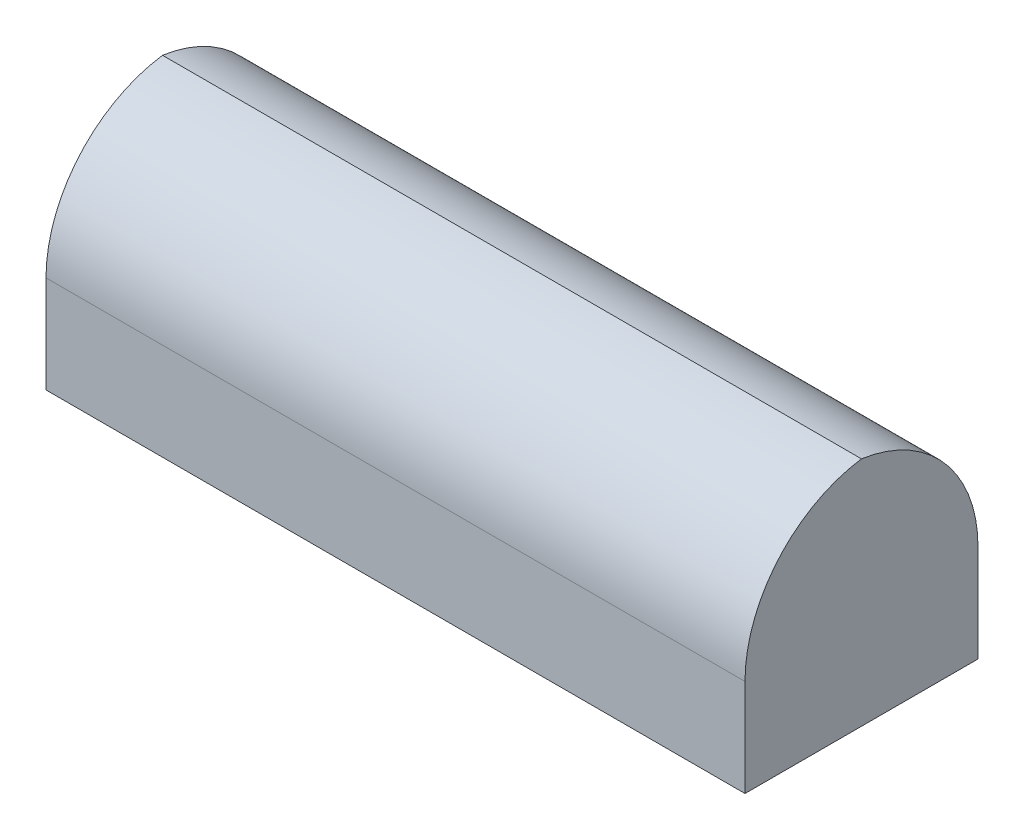
ISO-10303-21;
HEADER;
FILE_DESCRIPTION(('STEP AP214'),'2;1');
FILE_NAME('part.step','',(''),(''),'','','');
FILE_SCHEMA(('AUTOMOTIVE_DESIGN { 1 0 10303 214 1 1 1 1 }'));
ENDSEC;
DATA;
#1=APPLICATION_CONTEXT('core data for automotive mechanical design processes');
#2=APPLICATION_PROTOCOL_DEFINITION('international standard','automotive_design',2000,#1);
#3=PRODUCT_CONTEXT('',#1,'mechanical');
#4=PRODUCT('Part','Part','',(#3));
#5=PRODUCT_RELATED_PRODUCT_CATEGORY('part','',(#4));
#6=PRODUCT_DEFINITION_FORMATION('','',#4);
#7=PRODUCT_DEFINITION_CONTEXT('part definition',#1,'design');
#8=PRODUCT_DEFINITION('design','',#6,#7);
#9=PRODUCT_DEFINITION_SHAPE('','',#8);
#10=(LENGTH_UNIT() NAMED_UNIT(*) SI_UNIT(.MILLI.,.METRE.));
#11=(NAMED_UNIT(*) PLANE_ANGLE_UNIT() SI_UNIT($,.RADIAN.));
#12=(NAMED_UNIT(*) SI_UNIT($,.STERADIAN.) SOLID_ANGLE_UNIT());
#13=UNCERTAINTY_MEASURE_WITH_UNIT(LENGTH_MEASURE(1.E-05),#10,'distance_accuracy_value','');
#14=(GEOMETRIC_REPRESENTATION_CONTEXT(3) GLOBAL_UNCERTAINTY_ASSIGNED_CONTEXT((#13)) GLOBAL_UNIT_ASSIGNED_CONTEXT((#10,
#11,#12)) REPRESENTATION_CONTEXT('',''));
#15=CARTESIAN_POINT('',(0.,0.,0.));
#16=DIRECTION('',(0.,0.,1.));
#17=DIRECTION('',(1.,0.,0.));
#18=AXIS2_PLACEMENT_3D('',#15,#16,#17);
#19=CARTESIAN_POINT('',(0.,5.35,-1.85));
#20=DIRECTION('',(1.,0.,0.));
#21=DIRECTION('',(0.,0.,-1.));
#22=AXIS2_PLACEMENT_3D('',#19,#20,#21);
#23=CYLINDRICAL_SURFACE('',#22,0.7);
#24=DIRECTION('',(-1.,0.,0.));
#25=VECTOR('',#24,1.);
#26=CARTESIAN_POINT('',(0.,6.04282032302755,-1.95));
#27=LINE('',#26,#25);
#28=CARTESIAN_POINT('',(4.65,6.04282032302755,-1.95));
#29=VERTEX_POINT('',#28);
#30=CARTESIAN_POINT('',(1.05,6.04282032302755,-1.95));
#31=VERTEX_POINT('',#30);
#32=EDGE_CURVE('E63',#29,#31,#27,.T.);
#33=ORIENTED_EDGE('',*,*,#32,.F.);
#34=CARTESIAN_POINT('',(4.65,5.35,-1.85));
#35=DIRECTION('',(1.,0.,0.));
#36=DIRECTION('',(0.,0.,-1.));
#37=AXIS2_PLACEMENT_3D('',#34,#35,#36);
#38=CIRCLE('',#37,0.7);
#39=CARTESIAN_POINT('',(4.65,5.35,-2.55));
#40=VERTEX_POINT('',#39);
#41=EDGE_CURVE('E86',#29,#40,#38,.F.);
#42=ORIENTED_EDGE('',*,*,#41,.T.);
#43=DIRECTION('',(1.,0.,0.));
#44=VECTOR('',#43,1.);
#45=CARTESIAN_POINT('',(4.65,5.35,-2.55));
#46=LINE('',#45,#44);
#47=CARTESIAN_POINT('',(1.05,5.35,-2.55));
#48=VERTEX_POINT('',#47);
#49=EDGE_CURVE('E66',#40,#48,#46,.F.);
#50=ORIENTED_EDGE('',*,*,#49,.T.);
#51=CARTESIAN_POINT('',(1.05,5.35,-1.85));
#52=DIRECTION('',(1.,0.,0.));
#53=DIRECTION('',(0.,0.,-1.));
#54=AXIS2_PLACEMENT_3D('',#51,#52,#53);
#55=CIRCLE('',#54,0.7);
#56=EDGE_CURVE('E20',#48,#31,#55,.T.);
#57=ORIENTED_EDGE('',*,*,#56,.T.);
#58=EDGE_LOOP('',(#33,#42,#50,#57));
#59=FACE_BOUND('',#58,.T.);
#60=ADVANCED_FACE('F17',(#59),#23,.T.);
#61=CARTESIAN_POINT('',(0.,5.35,-2.05));
#62=DIRECTION('',(-1.,0.,0.));
#63=DIRECTION('',(0.,0.,1.));
#64=AXIS2_PLACEMENT_3D('',#61,#62,#63);
#65=CYLINDRICAL_SURFACE('',#64,0.7);
#66=CARTESIAN_POINT('',(4.65,5.35,-2.05));
#67=DIRECTION('',(-1.,0.,0.));
#68=DIRECTION('',(0.,0.,1.));
#69=AXIS2_PLACEMENT_3D('',#66,#67,#68);
#70=CIRCLE('',#69,0.7);
#71=CARTESIAN_POINT('',(4.65,5.35,-1.35));
#72=VERTEX_POINT('',#71);
#73=EDGE_CURVE('E73',#72,#29,#70,.T.);
#74=ORIENTED_EDGE('',*,*,#73,.T.);
#75=ORIENTED_EDGE('',*,*,#32,.T.);
#76=CARTESIAN_POINT('',(1.05,5.35,-2.05));
#77=DIRECTION('',(-1.,0.,0.));
#78=DIRECTION('',(0.,0.,1.));
#79=AXIS2_PLACEMENT_3D('',#76,#77,#78);
#80=CIRCLE('',#79,0.7);
#81=CARTESIAN_POINT('',(1.05,5.35,-1.35));
#82=VERTEX_POINT('',#81);
#83=EDGE_CURVE('E72',#31,#82,#80,.F.);
#84=ORIENTED_EDGE('',*,*,#83,.T.);
#85=DIRECTION('',(-1.,0.,0.));
#86=VECTOR('',#85,1.);
#87=CARTESIAN_POINT('',(1.05,5.35,-1.35));
#88=LINE('',#87,#86);
#89=EDGE_CURVE('E79',#82,#72,#88,.F.);
#90=ORIENTED_EDGE('',*,*,#89,.T.);
#91=EDGE_LOOP('',(#74,#75,#84,#90));
#92=FACE_BOUND('',#91,.T.);
#93=ADVANCED_FACE('F70',(#92),#65,.T.);
#94=CARTESIAN_POINT('',(4.65,6.05,-1.35));
#95=DIRECTION('',(-1.,0.,0.));
#96=DIRECTION('',(0.,0.,1.));
#97=AXIS2_PLACEMENT_3D('',#94,#95,#96);
#98=PLANE('',#97);
#99=ORIENTED_EDGE('',*,*,#73,.F.);
#100=DIRECTION('',(0.,1.,0.));
#101=VECTOR('',#100,1.);
#102=CARTESIAN_POINT('',(4.65,6.05,-1.35));
#103=LINE('',#102,#101);
#104=CARTESIAN_POINT('',(4.65,4.85,-1.35));
#105=VERTEX_POINT('',#104);
#106=EDGE_CURVE('E109',#72,#105,#103,.F.);
#107=ORIENTED_EDGE('',*,*,#106,.T.);
#108=DIRECTION('',(0.,0.,1.));
#109=VECTOR('',#108,1.);
#110=CARTESIAN_POINT('',(4.65,4.85,0.));
#111=LINE('',#110,#109);
#112=CARTESIAN_POINT('',(4.65,4.85,-2.55));
#113=VERTEX_POINT('',#112);
#114=EDGE_CURVE('E97',#105,#113,#111,.F.);
#115=ORIENTED_EDGE('',*,*,#114,.T.);
#116=DIRECTION('',(0.,1.,0.));
#117=VECTOR('',#116,1.);
#118=CARTESIAN_POINT('',(4.65,6.05,-2.55));
#119=LINE('',#118,#117);
#120=EDGE_CURVE('E87',#113,#40,#119,.T.);
#121=ORIENTED_EDGE('',*,*,#120,.T.);
#122=ORIENTED_EDGE('',*,*,#41,.F.);
#123=EDGE_LOOP('',(#99,#107,#115,#121,#122));
#124=FACE_BOUND('',#123,.T.);
#125=ADVANCED_FACE('F118',(#124),#98,.F.);
#126=CARTESIAN_POINT('',(4.65,6.05,-2.55));
#127=DIRECTION('',(0.,0.,1.));
#128=DIRECTION('',(1.,0.,0.));
#129=AXIS2_PLACEMENT_3D('',#126,#127,#128);
#130=PLANE('',#129);
#131=ORIENTED_EDGE('',*,*,#49,.F.);
#132=ORIENTED_EDGE('',*,*,#120,.F.);
#133=DIRECTION('',(1.,0.,0.));
#134=VECTOR('',#133,1.);
#135=CARTESIAN_POINT('',(0.,4.85,-2.55));
#136=LINE('',#135,#134);
#137=CARTESIAN_POINT('',(1.05,4.85,-2.55));
#138=VERTEX_POINT('',#137);
#139=EDGE_CURVE('E95',#113,#138,#136,.F.);
#140=ORIENTED_EDGE('',*,*,#139,.T.);
#141=DIRECTION('',(0.,1.,0.));
#142=VECTOR('',#141,1.);
#143=CARTESIAN_POINT('',(1.05,6.05,-2.55));
#144=LINE('',#143,#142);
#145=EDGE_CURVE('E77',#138,#48,#144,.T.);
#146=ORIENTED_EDGE('',*,*,#145,.T.);
#147=EDGE_LOOP('',(#131,#132,#140,#146));
#148=FACE_BOUND('',#147,.T.);
#149=ADVANCED_FACE('F125',(#148),#130,.F.);
#150=CARTESIAN_POINT('',(1.05,6.05,-2.55));
#151=DIRECTION('',(1.,0.,0.));
#152=DIRECTION('',(0.,0.,-1.));
#153=AXIS2_PLACEMENT_3D('',#150,#151,#152);
#154=PLANE('',#153);
#155=ORIENTED_EDGE('',*,*,#83,.F.);
#156=ORIENTED_EDGE('',*,*,#56,.F.);
#157=ORIENTED_EDGE('',*,*,#145,.F.);
#158=DIRECTION('',(0.,0.,1.));
#159=VECTOR('',#158,1.);
#160=CARTESIAN_POINT('',(1.05,4.85,0.));
#161=LINE('',#160,#159);
#162=CARTESIAN_POINT('',(1.05,4.85,-1.35));
#163=VERTEX_POINT('',#162);
#164=EDGE_CURVE('E26',#138,#163,#161,.T.);
#165=ORIENTED_EDGE('',*,*,#164,.T.);
#166=DIRECTION('',(0.,1.,0.));
#167=VECTOR('',#166,1.);
#168=CARTESIAN_POINT('',(1.05,6.05,-1.35));
#169=LINE('',#168,#167);
#170=EDGE_CURVE('E34',#163,#82,#169,.T.);
#171=ORIENTED_EDGE('',*,*,#170,.T.);
#172=EDGE_LOOP('',(#155,#156,#157,#165,#171));
#173=FACE_BOUND('',#172,.T.);
#174=ADVANCED_FACE('F75',(#173),#154,.F.);
#175=CARTESIAN_POINT('',(1.05,6.05,-1.35));
#176=DIRECTION('',(0.,0.,-1.));
#177=DIRECTION('',(-1.,0.,0.));
#178=AXIS2_PLACEMENT_3D('',#175,#176,#177);
#179=PLANE('',#178);
#180=ORIENTED_EDGE('',*,*,#89,.F.);
#181=ORIENTED_EDGE('',*,*,#170,.F.);
#182=DIRECTION('',(1.,0.,0.));
#183=VECTOR('',#182,1.);
#184=CARTESIAN_POINT('',(0.,4.85,-1.35));
#185=LINE('',#184,#183);
#186=EDGE_CURVE('E11',#163,#105,#185,.T.);
#187=ORIENTED_EDGE('',*,*,#186,.T.);
#188=ORIENTED_EDGE('',*,*,#106,.F.);
#189=EDGE_LOOP('',(#180,#181,#187,#188));
#190=FACE_BOUND('',#189,.T.);
#191=ADVANCED_FACE('F117',(#190),#179,.F.);
#192=CARTESIAN_POINT('',(0.,4.85,0.));
#193=DIRECTION('',(0.,1.,0.));
#194=DIRECTION('',(0.,0.,1.));
#195=AXIS2_PLACEMENT_3D('',#192,#193,#194);
#196=PLANE('',#195);
#197=ORIENTED_EDGE('',*,*,#164,.F.);
#198=ORIENTED_EDGE('',*,*,#139,.F.);
#199=ORIENTED_EDGE('',*,*,#114,.F.);
#200=ORIENTED_EDGE('',*,*,#186,.F.);
#201=EDGE_LOOP('',(#197,#198,#199,#200));
#202=FACE_BOUND('',#201,.T.);
#203=ADVANCED_FACE('F123',(#202),#196,.F.);
#204=CLOSED_SHELL('',(#60,#93,#125,#149,#174,#191,#203));
#205=MANIFOLD_SOLID_BREP('B1',#204);
#206=ADVANCED_BREP_SHAPE_REPRESENTATION('',(#18,#205),#14);
#207=SHAPE_DEFINITION_REPRESENTATION(#9,#206);
ENDSEC;
END-ISO-10303-21;
